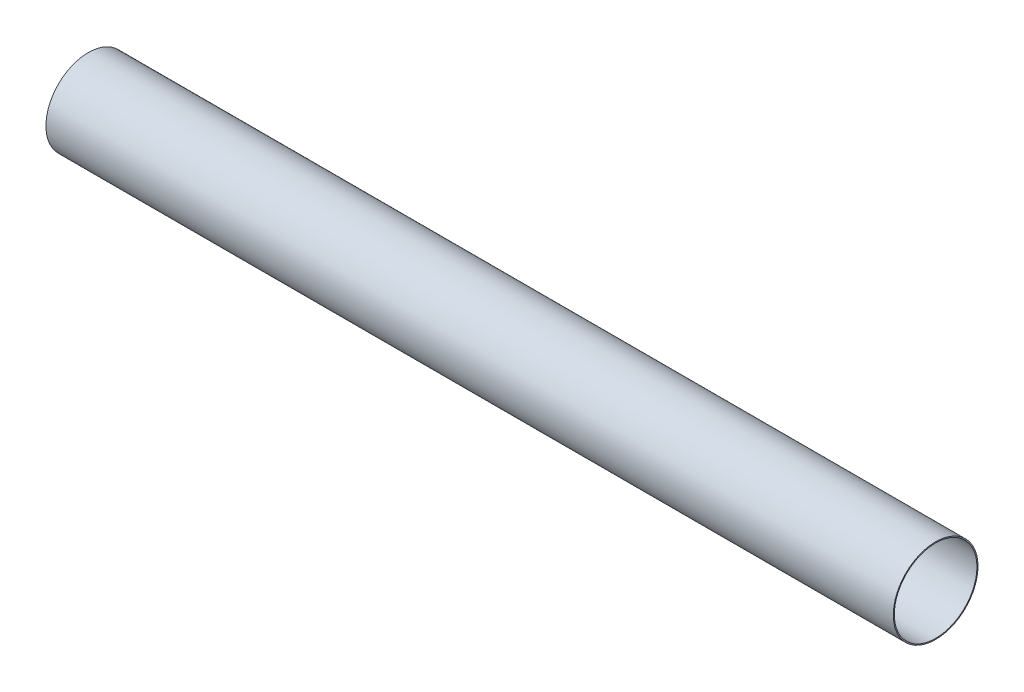
ISO-10303-21;
HEADER;
FILE_DESCRIPTION(('STEP AP214'),'2;1');
FILE_NAME('part.step','',(''),(''),'','','');
FILE_SCHEMA(('AUTOMOTIVE_DESIGN { 1 0 10303 214 1 1 1 1 }'));
ENDSEC;
DATA;
#1=APPLICATION_CONTEXT('core data for automotive mechanical design processes');
#2=APPLICATION_PROTOCOL_DEFINITION('international standard','automotive_design',2000,#1);
#3=PRODUCT_CONTEXT('',#1,'mechanical');
#4=PRODUCT('Part','Part','',(#3));
#5=PRODUCT_RELATED_PRODUCT_CATEGORY('part','',(#4));
#6=PRODUCT_DEFINITION_FORMATION('','',#4);
#7=PRODUCT_DEFINITION_CONTEXT('part definition',#1,'design');
#8=PRODUCT_DEFINITION('design','',#6,#7);
#9=PRODUCT_DEFINITION_SHAPE('','',#8);
#10=(LENGTH_UNIT() NAMED_UNIT(*) SI_UNIT(.MILLI.,.METRE.));
#11=(NAMED_UNIT(*) PLANE_ANGLE_UNIT() SI_UNIT($,.RADIAN.));
#12=(NAMED_UNIT(*) SI_UNIT($,.STERADIAN.) SOLID_ANGLE_UNIT());
#13=UNCERTAINTY_MEASURE_WITH_UNIT(LENGTH_MEASURE(1.E-05),#10,'distance_accuracy_value','');
#14=(GEOMETRIC_REPRESENTATION_CONTEXT(3) GLOBAL_UNCERTAINTY_ASSIGNED_CONTEXT((#13)) GLOBAL_UNIT_ASSIGNED_CONTEXT((#10,
#11,#12)) REPRESENTATION_CONTEXT('',''));
#15=CARTESIAN_POINT('',(0.,0.,0.));
#16=DIRECTION('',(0.,0.,1.));
#17=DIRECTION('',(1.,0.,0.));
#18=AXIS2_PLACEMENT_3D('',#15,#16,#17);
#19=CARTESIAN_POINT('',(3048.,0.,0.));
#20=DIRECTION('',(1.,0.,0.));
#21=DIRECTION('',(0.,0.,-1.));
#22=AXIS2_PLACEMENT_3D('',#19,#20,#21);
#23=PLANE('',#22);
#24=CARTESIAN_POINT('',(3048.,0.,0.));
#25=DIRECTION('',(1.,0.,0.));
#26=DIRECTION('',(0.,0.,-1.));
#27=AXIS2_PLACEMENT_3D('',#24,#25,#26);
#28=CIRCLE('',#27,152.4);
#29=CARTESIAN_POINT('',(3048.,0.,-152.4));
#30=VERTEX_POINT('',#29);
#31=EDGE_CURVE('E10',#30,#30,#28,.T.);
#32=ORIENTED_EDGE('',*,*,#31,.T.);
#33=EDGE_LOOP('',(#32));
#34=FACE_BOUND('',#33,.T.);
#35=CARTESIAN_POINT('',(3048.,0.,0.));
#36=DIRECTION('',(1.,0.,0.));
#37=DIRECTION('',(0.,0.,-1.));
#38=AXIS2_PLACEMENT_3D('',#35,#36,#37);
#39=CIRCLE('',#38,148.59);
#40=CARTESIAN_POINT('',(3048.,0.,-148.59));
#41=VERTEX_POINT('',#40);
#42=EDGE_CURVE('E52',#41,#41,#39,.T.);
#43=ORIENTED_EDGE('',*,*,#42,.F.);
#44=EDGE_LOOP('',(#43));
#45=FACE_BOUND('',#44,.T.);
#46=ADVANCED_FACE('F39',(#34,#45),#23,.T.);
#47=CARTESIAN_POINT('',(0.,0.,0.));
#48=DIRECTION('',(1.,0.,0.));
#49=DIRECTION('',(0.,0.,-1.));
#50=AXIS2_PLACEMENT_3D('',#47,#48,#49);
#51=PLANE('',#50);
#52=CARTESIAN_POINT('',(0.,0.,0.));
#53=DIRECTION('',(1.,0.,0.));
#54=DIRECTION('',(0.,0.,-1.));
#55=AXIS2_PLACEMENT_3D('',#52,#53,#54);
#56=CIRCLE('',#55,152.4);
#57=CARTESIAN_POINT('',(0.,0.,-152.4));
#58=VERTEX_POINT('',#57);
#59=EDGE_CURVE('E43',#58,#58,#56,.T.);
#60=ORIENTED_EDGE('',*,*,#59,.F.);
#61=EDGE_LOOP('',(#60));
#62=FACE_BOUND('',#61,.T.);
#63=CARTESIAN_POINT('',(0.,0.,0.));
#64=DIRECTION('',(1.,0.,0.));
#65=DIRECTION('',(0.,0.,-1.));
#66=AXIS2_PLACEMENT_3D('',#63,#64,#65);
#67=CIRCLE('',#66,148.59);
#68=CARTESIAN_POINT('',(0.,0.,-148.59));
#69=VERTEX_POINT('',#68);
#70=EDGE_CURVE('E54',#69,#69,#67,.T.);
#71=ORIENTED_EDGE('',*,*,#70,.T.);
#72=EDGE_LOOP('',(#71));
#73=FACE_BOUND('',#72,.T.);
#74=ADVANCED_FACE('F66',(#62,#73),#51,.F.);
#75=CARTESIAN_POINT('',(3048.,0.,0.));
#76=DIRECTION('',(-1.,0.,0.));
#77=DIRECTION('',(0.,0.,1.));
#78=AXIS2_PLACEMENT_3D('',#75,#76,#77);
#79=CYLINDRICAL_SURFACE('',#78,152.4);
#80=ORIENTED_EDGE('',*,*,#31,.F.);
#81=EDGE_LOOP('',(#80));
#82=FACE_BOUND('',#81,.T.);
#83=ORIENTED_EDGE('',*,*,#59,.T.);
#84=EDGE_LOOP('',(#83));
#85=FACE_BOUND('',#84,.T.);
#86=ADVANCED_FACE('F41',(#82,#85),#79,.T.);
#87=CARTESIAN_POINT('',(3048.,0.,0.));
#88=DIRECTION('',(-1.,0.,0.));
#89=DIRECTION('',(0.,0.,1.));
#90=AXIS2_PLACEMENT_3D('',#87,#88,#89);
#91=CYLINDRICAL_SURFACE('',#90,148.59);
#92=ORIENTED_EDGE('',*,*,#42,.T.);
#93=EDGE_LOOP('',(#92));
#94=FACE_BOUND('',#93,.T.);
#95=ORIENTED_EDGE('',*,*,#70,.F.);
#96=EDGE_LOOP('',(#95));
#97=FACE_BOUND('',#96,.T.);
#98=ADVANCED_FACE('F62',(#94,#97),#91,.F.);
#99=CLOSED_SHELL('',(#46,#74,#86,#98));
#100=MANIFOLD_SOLID_BREP('B2',#99);
#101=ADVANCED_BREP_SHAPE_REPRESENTATION('',(#18,#100),#14);
#102=SHAPE_DEFINITION_REPRESENTATION(#9,#101);
ENDSEC;
END-ISO-10303-21;
